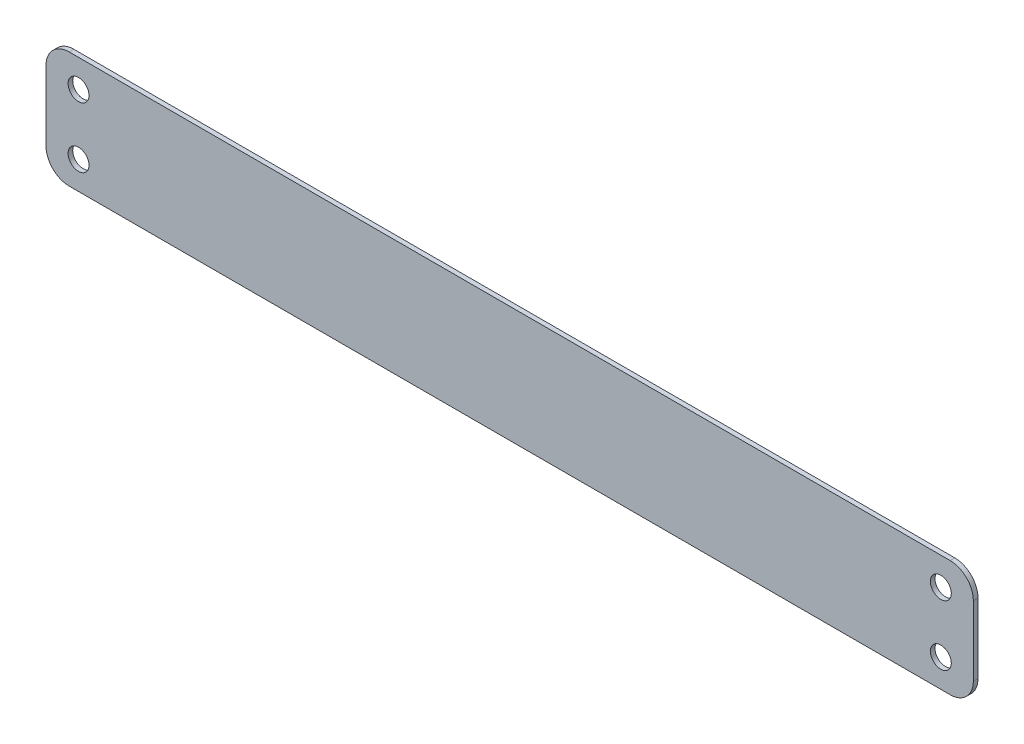
ISO-10303-21;
HEADER;
FILE_DESCRIPTION(('STEP AP214'),'2;1');
FILE_NAME('part.step','',(''),(''),'','','');
FILE_SCHEMA(('AUTOMOTIVE_DESIGN { 1 0 10303 214 1 1 1 1 }'));
ENDSEC;
DATA;
#1=APPLICATION_CONTEXT('core data for automotive mechanical design processes');
#2=APPLICATION_PROTOCOL_DEFINITION('international standard','automotive_design',2000,#1);
#3=PRODUCT_CONTEXT('',#1,'mechanical');
#4=PRODUCT('Part','Part','',(#3));
#5=PRODUCT_RELATED_PRODUCT_CATEGORY('part','',(#4));
#6=PRODUCT_DEFINITION_FORMATION('','',#4);
#7=PRODUCT_DEFINITION_CONTEXT('part definition',#1,'design');
#8=PRODUCT_DEFINITION('design','',#6,#7);
#9=PRODUCT_DEFINITION_SHAPE('','',#8);
#10=(LENGTH_UNIT() NAMED_UNIT(*) SI_UNIT(.MILLI.,.METRE.));
#11=(NAMED_UNIT(*) PLANE_ANGLE_UNIT() SI_UNIT($,.RADIAN.));
#12=(NAMED_UNIT(*) SI_UNIT($,.STERADIAN.) SOLID_ANGLE_UNIT());
#13=UNCERTAINTY_MEASURE_WITH_UNIT(LENGTH_MEASURE(1.E-05),#10,'distance_accuracy_value','');
#14=(GEOMETRIC_REPRESENTATION_CONTEXT(3) GLOBAL_UNCERTAINTY_ASSIGNED_CONTEXT((#13)) GLOBAL_UNIT_ASSIGNED_CONTEXT((#10,
#11,#12)) REPRESENTATION_CONTEXT('',''));
#15=CARTESIAN_POINT('',(0.,0.,0.));
#16=DIRECTION('',(0.,0.,1.));
#17=DIRECTION('',(1.,0.,0.));
#18=AXIS2_PLACEMENT_3D('',#15,#16,#17);
#19=CARTESIAN_POINT('',(199.5,-25.,-2.));
#20=DIRECTION('',(1.,0.,0.));
#21=DIRECTION('',(0.,0.,-1.));
#22=AXIS2_PLACEMENT_3D('',#19,#20,#21);
#23=PLANE('',#22);
#24=DIRECTION('',(0.,1.,0.));
#25=VECTOR('',#24,1.);
#26=CARTESIAN_POINT('',(199.5,-25.,-2.));
#27=LINE('',#26,#25);
#28=CARTESIAN_POINT('',(199.5,-15.,-2.));
#29=VERTEX_POINT('',#28);
#30=CARTESIAN_POINT('',(199.5,15.,-2.));
#31=VERTEX_POINT('',#30);
#32=EDGE_CURVE('E193',#29,#31,#27,.T.);
#33=ORIENTED_EDGE('',*,*,#32,.T.);
#34=DIRECTION('',(0.,0.,1.));
#35=VECTOR('',#34,1.);
#36=CARTESIAN_POINT('',(199.5,15.,-2.));
#37=LINE('',#36,#35);
#38=CARTESIAN_POINT('',(199.5,15.,0.));
#39=VERTEX_POINT('',#38);
#40=EDGE_CURVE('E127',#31,#39,#37,.T.);
#41=ORIENTED_EDGE('',*,*,#40,.T.);
#42=DIRECTION('',(0.,1.,0.));
#43=VECTOR('',#42,1.);
#44=CARTESIAN_POINT('',(199.5,-25.,0.));
#45=LINE('',#44,#43);
#46=CARTESIAN_POINT('',(199.5,-15.,0.));
#47=VERTEX_POINT('',#46);
#48=EDGE_CURVE('E110',#47,#39,#45,.T.);
#49=ORIENTED_EDGE('',*,*,#48,.F.);
#50=DIRECTION('',(0.,0.,1.));
#51=VECTOR('',#50,1.);
#52=CARTESIAN_POINT('',(199.5,-15.,-2.));
#53=LINE('',#52,#51);
#54=EDGE_CURVE('E124',#47,#29,#53,.F.);
#55=ORIENTED_EDGE('',*,*,#54,.T.);
#56=EDGE_LOOP('',(#33,#41,#49,#55));
#57=FACE_BOUND('',#56,.T.);
#58=ADVANCED_FACE('F40',(#57),#23,.T.);
#59=CARTESIAN_POINT('',(-199.5,-25.,-2.));
#60=DIRECTION('',(0.,-1.,0.));
#61=DIRECTION('',(0.,0.,-1.));
#62=AXIS2_PLACEMENT_3D('',#59,#60,#61);
#63=PLANE('',#62);
#64=DIRECTION('',(1.,0.,0.));
#65=VECTOR('',#64,1.);
#66=CARTESIAN_POINT('',(-199.5,-25.,0.));
#67=LINE('',#66,#65);
#68=CARTESIAN_POINT('',(-189.5,-25.,0.));
#69=VERTEX_POINT('',#68);
#70=CARTESIAN_POINT('',(189.5,-25.,0.));
#71=VERTEX_POINT('',#70);
#72=EDGE_CURVE('E112',#69,#71,#67,.T.);
#73=ORIENTED_EDGE('',*,*,#72,.F.);
#74=DIRECTION('',(0.,0.,1.));
#75=VECTOR('',#74,1.);
#76=CARTESIAN_POINT('',(-189.5,-25.,-2.));
#77=LINE('',#76,#75);
#78=CARTESIAN_POINT('',(-189.5,-25.,-2.));
#79=VERTEX_POINT('',#78);
#80=EDGE_CURVE('E11',#69,#79,#77,.F.);
#81=ORIENTED_EDGE('',*,*,#80,.T.);
#82=DIRECTION('',(1.,0.,0.));
#83=VECTOR('',#82,1.);
#84=CARTESIAN_POINT('',(-199.5,-25.,-2.));
#85=LINE('',#84,#83);
#86=CARTESIAN_POINT('',(189.5,-25.,-2.));
#87=VERTEX_POINT('',#86);
#88=EDGE_CURVE('E136',#79,#87,#85,.T.);
#89=ORIENTED_EDGE('',*,*,#88,.T.);
#90=DIRECTION('',(0.,0.,1.));
#91=VECTOR('',#90,1.);
#92=CARTESIAN_POINT('',(189.5,-25.,-2.));
#93=LINE('',#92,#91);
#94=EDGE_CURVE('E49',#87,#71,#93,.T.);
#95=ORIENTED_EDGE('',*,*,#94,.T.);
#96=EDGE_LOOP('',(#73,#81,#89,#95));
#97=FACE_BOUND('',#96,.T.);
#98=ADVANCED_FACE('F179',(#97),#63,.T.);
#99=CARTESIAN_POINT('',(-199.5,-25.,-2.));
#100=DIRECTION('',(-1.,0.,0.));
#101=DIRECTION('',(0.,0.,1.));
#102=AXIS2_PLACEMENT_3D('',#99,#100,#101);
#103=PLANE('',#102);
#104=DIRECTION('',(0.,-1.,0.));
#105=VECTOR('',#104,1.);
#106=CARTESIAN_POINT('',(-199.5,-25.,-2.));
#107=LINE('',#106,#105);
#108=CARTESIAN_POINT('',(-199.5,15.,-2.));
#109=VERTEX_POINT('',#108);
#110=CARTESIAN_POINT('',(-199.5,-15.,-2.));
#111=VERTEX_POINT('',#110);
#112=EDGE_CURVE('E144',#109,#111,#107,.T.);
#113=ORIENTED_EDGE('',*,*,#112,.T.);
#114=DIRECTION('',(0.,0.,1.));
#115=VECTOR('',#114,1.);
#116=CARTESIAN_POINT('',(-199.5,-15.,-2.));
#117=LINE('',#116,#115);
#118=CARTESIAN_POINT('',(-199.5,-15.,0.));
#119=VERTEX_POINT('',#118);
#120=EDGE_CURVE('E174',#111,#119,#117,.T.);
#121=ORIENTED_EDGE('',*,*,#120,.T.);
#122=DIRECTION('',(0.,-1.,0.));
#123=VECTOR('',#122,1.);
#124=CARTESIAN_POINT('',(-199.5,-25.,0.));
#125=LINE('',#124,#123);
#126=CARTESIAN_POINT('',(-199.5,15.,0.));
#127=VERTEX_POINT('',#126);
#128=EDGE_CURVE('E188',#127,#119,#125,.T.);
#129=ORIENTED_EDGE('',*,*,#128,.F.);
#130=DIRECTION('',(0.,0.,1.));
#131=VECTOR('',#130,1.);
#132=CARTESIAN_POINT('',(-199.5,15.,-2.));
#133=LINE('',#132,#131);
#134=EDGE_CURVE('E63',#127,#109,#133,.F.);
#135=ORIENTED_EDGE('',*,*,#134,.T.);
#136=EDGE_LOOP('',(#113,#121,#129,#135));
#137=FACE_BOUND('',#136,.T.);
#138=ADVANCED_FACE('F187',(#137),#103,.T.);
#139=CARTESIAN_POINT('',(-199.5,25.,-2.));
#140=DIRECTION('',(0.,1.,0.));
#141=DIRECTION('',(0.,0.,1.));
#142=AXIS2_PLACEMENT_3D('',#139,#140,#141);
#143=PLANE('',#142);
#144=DIRECTION('',(-1.,0.,0.));
#145=VECTOR('',#144,1.);
#146=CARTESIAN_POINT('',(-199.5,25.,0.));
#147=LINE('',#146,#145);
#148=CARTESIAN_POINT('',(189.5,25.,0.));
#149=VERTEX_POINT('',#148);
#150=CARTESIAN_POINT('',(-189.5,25.,0.));
#151=VERTEX_POINT('',#150);
#152=EDGE_CURVE('E129',#149,#151,#147,.T.);
#153=ORIENTED_EDGE('',*,*,#152,.F.);
#154=DIRECTION('',(0.,0.,1.));
#155=VECTOR('',#154,1.);
#156=CARTESIAN_POINT('',(189.5,25.,-2.));
#157=LINE('',#156,#155);
#158=CARTESIAN_POINT('',(189.5,25.,-2.));
#159=VERTEX_POINT('',#158);
#160=EDGE_CURVE('E160',#149,#159,#157,.F.);
#161=ORIENTED_EDGE('',*,*,#160,.T.);
#162=DIRECTION('',(-1.,0.,0.));
#163=VECTOR('',#162,1.);
#164=CARTESIAN_POINT('',(-199.5,25.,-2.));
#165=LINE('',#164,#163);
#166=CARTESIAN_POINT('',(-189.5,25.,-2.));
#167=VERTEX_POINT('',#166);
#168=EDGE_CURVE('E199',#159,#167,#165,.T.);
#169=ORIENTED_EDGE('',*,*,#168,.T.);
#170=DIRECTION('',(0.,0.,1.));
#171=VECTOR('',#170,1.);
#172=CARTESIAN_POINT('',(-189.5,25.,-2.));
#173=LINE('',#172,#171);
#174=EDGE_CURVE('E156',#167,#151,#173,.T.);
#175=ORIENTED_EDGE('',*,*,#174,.T.);
#176=EDGE_LOOP('',(#153,#161,#169,#175));
#177=FACE_BOUND('',#176,.T.);
#178=ADVANCED_FACE('F239',(#177),#143,.T.);
#179=CARTESIAN_POINT('',(0.,0.,-2.));
#180=DIRECTION('',(0.,0.,-1.));
#181=DIRECTION('',(-1.,0.,0.));
#182=AXIS2_PLACEMENT_3D('',#179,#180,#181);
#183=PLANE('',#182);
#184=CARTESIAN_POINT('',(-185.5,13.,-2.));
#185=DIRECTION('',(0.,0.,-1.));
#186=DIRECTION('',(-1.,0.,0.));
#187=AXIS2_PLACEMENT_3D('',#184,#185,#186);
#188=CIRCLE('',#187,4.5);
#189=CARTESIAN_POINT('',(-190.,13.,-2.));
#190=VERTEX_POINT('',#189);
#191=EDGE_CURVE('E230',#190,#190,#188,.T.);
#192=ORIENTED_EDGE('',*,*,#191,.F.);
#193=EDGE_LOOP('',(#192));
#194=FACE_BOUND('',#193,.T.);
#195=CARTESIAN_POINT('',(-185.5,-13.,-2.));
#196=DIRECTION('',(0.,0.,-1.));
#197=DIRECTION('',(-1.,0.,0.));
#198=AXIS2_PLACEMENT_3D('',#195,#196,#197);
#199=CIRCLE('',#198,4.5);
#200=CARTESIAN_POINT('',(-190.,-13.,-2.));
#201=VERTEX_POINT('',#200);
#202=EDGE_CURVE('E222',#201,#201,#199,.T.);
#203=ORIENTED_EDGE('',*,*,#202,.F.);
#204=EDGE_LOOP('',(#203));
#205=FACE_BOUND('',#204,.T.);
#206=CARTESIAN_POINT('',(185.5,13.,-2.));
#207=DIRECTION('',(0.,0.,-1.));
#208=DIRECTION('',(-1.,0.,0.));
#209=AXIS2_PLACEMENT_3D('',#206,#207,#208);
#210=CIRCLE('',#209,4.5);
#211=CARTESIAN_POINT('',(181.,13.,-2.));
#212=VERTEX_POINT('',#211);
#213=EDGE_CURVE('E215',#212,#212,#210,.T.);
#214=ORIENTED_EDGE('',*,*,#213,.F.);
#215=EDGE_LOOP('',(#214));
#216=FACE_BOUND('',#215,.T.);
#217=CARTESIAN_POINT('',(185.5,-13.,-2.));
#218=DIRECTION('',(0.,0.,-1.));
#219=DIRECTION('',(-1.,0.,0.));
#220=AXIS2_PLACEMENT_3D('',#217,#218,#219);
#221=CIRCLE('',#220,4.5);
#222=CARTESIAN_POINT('',(181.,-13.,-2.));
#223=VERTEX_POINT('',#222);
#224=EDGE_CURVE('E207',#223,#223,#221,.T.);
#225=ORIENTED_EDGE('',*,*,#224,.F.);
#226=EDGE_LOOP('',(#225));
#227=FACE_BOUND('',#226,.T.);
#228=ORIENTED_EDGE('',*,*,#168,.F.);
#229=CARTESIAN_POINT('',(189.5,15.,-2.));
#230=DIRECTION('',(0.,0.,-1.));
#231=DIRECTION('',(-1.,0.,0.));
#232=AXIS2_PLACEMENT_3D('',#229,#230,#231);
#233=CIRCLE('',#232,10.);
#234=EDGE_CURVE('E169',#159,#31,#233,.T.);
#235=ORIENTED_EDGE('',*,*,#234,.T.);
#236=ORIENTED_EDGE('',*,*,#32,.F.);
#237=CARTESIAN_POINT('',(189.5,-15.,-2.));
#238=DIRECTION('',(0.,0.,-1.));
#239=DIRECTION('',(-1.,0.,0.));
#240=AXIS2_PLACEMENT_3D('',#237,#238,#239);
#241=CIRCLE('',#240,10.);
#242=EDGE_CURVE('E134',#29,#87,#241,.T.);
#243=ORIENTED_EDGE('',*,*,#242,.T.);
#244=ORIENTED_EDGE('',*,*,#88,.F.);
#245=CARTESIAN_POINT('',(-189.5,-15.,-2.));
#246=DIRECTION('',(0.,0.,-1.));
#247=DIRECTION('',(-1.,0.,0.));
#248=AXIS2_PLACEMENT_3D('',#245,#246,#247);
#249=CIRCLE('',#248,10.);
#250=EDGE_CURVE('E56',#79,#111,#249,.T.);
#251=ORIENTED_EDGE('',*,*,#250,.T.);
#252=ORIENTED_EDGE('',*,*,#112,.F.);
#253=CARTESIAN_POINT('',(-189.5,15.,-2.));
#254=DIRECTION('',(0.,0.,-1.));
#255=DIRECTION('',(-1.,0.,0.));
#256=AXIS2_PLACEMENT_3D('',#253,#254,#255);
#257=CIRCLE('',#256,10.);
#258=EDGE_CURVE('E163',#109,#167,#257,.T.);
#259=ORIENTED_EDGE('',*,*,#258,.T.);
#260=EDGE_LOOP('',(#228,#235,#236,#243,#244,#251,#252,#259));
#261=FACE_BOUND('',#260,.T.);
#262=ADVANCED_FACE('F182',(#194,#205,#216,#227,#261),#183,.T.);
#263=CARTESIAN_POINT('',(0.,0.,0.));
#264=DIRECTION('',(0.,0.,-1.));
#265=DIRECTION('',(-1.,0.,0.));
#266=AXIS2_PLACEMENT_3D('',#263,#264,#265);
#267=PLANE('',#266);
#268=CARTESIAN_POINT('',(-185.5,13.,0.));
#269=DIRECTION('',(0.,0.,-1.));
#270=DIRECTION('',(-1.,0.,0.));
#271=AXIS2_PLACEMENT_3D('',#268,#269,#270);
#272=CIRCLE('',#271,4.5);
#273=CARTESIAN_POINT('',(-190.,13.,0.));
#274=VERTEX_POINT('',#273);
#275=EDGE_CURVE('E226',#274,#274,#272,.T.);
#276=ORIENTED_EDGE('',*,*,#275,.T.);
#277=EDGE_LOOP('',(#276));
#278=FACE_BOUND('',#277,.T.);
#279=CARTESIAN_POINT('',(-185.5,-13.,0.));
#280=DIRECTION('',(0.,0.,-1.));
#281=DIRECTION('',(-1.,0.,0.));
#282=AXIS2_PLACEMENT_3D('',#279,#280,#281);
#283=CIRCLE('',#282,4.5);
#284=CARTESIAN_POINT('',(-190.,-13.,0.));
#285=VERTEX_POINT('',#284);
#286=EDGE_CURVE('E218',#285,#285,#283,.T.);
#287=ORIENTED_EDGE('',*,*,#286,.T.);
#288=EDGE_LOOP('',(#287));
#289=FACE_BOUND('',#288,.T.);
#290=CARTESIAN_POINT('',(185.5,13.,0.));
#291=DIRECTION('',(0.,0.,-1.));
#292=DIRECTION('',(-1.,0.,0.));
#293=AXIS2_PLACEMENT_3D('',#290,#291,#292);
#294=CIRCLE('',#293,4.5);
#295=CARTESIAN_POINT('',(181.,13.,0.));
#296=VERTEX_POINT('',#295);
#297=EDGE_CURVE('E211',#296,#296,#294,.T.);
#298=ORIENTED_EDGE('',*,*,#297,.T.);
#299=EDGE_LOOP('',(#298));
#300=FACE_BOUND('',#299,.T.);
#301=CARTESIAN_POINT('',(185.5,-13.,0.));
#302=DIRECTION('',(0.,0.,-1.));
#303=DIRECTION('',(-1.,0.,0.));
#304=AXIS2_PLACEMENT_3D('',#301,#302,#303);
#305=CIRCLE('',#304,4.5);
#306=CARTESIAN_POINT('',(181.,-13.,0.));
#307=VERTEX_POINT('',#306);
#308=EDGE_CURVE('E130',#307,#307,#305,.T.);
#309=ORIENTED_EDGE('',*,*,#308,.T.);
#310=EDGE_LOOP('',(#309));
#311=FACE_BOUND('',#310,.T.);
#312=ORIENTED_EDGE('',*,*,#48,.T.);
#313=CARTESIAN_POINT('',(189.5,15.,0.));
#314=DIRECTION('',(0.,0.,-1.));
#315=DIRECTION('',(-1.,0.,0.));
#316=AXIS2_PLACEMENT_3D('',#313,#314,#315);
#317=CIRCLE('',#316,10.);
#318=EDGE_CURVE('E153',#39,#149,#317,.F.);
#319=ORIENTED_EDGE('',*,*,#318,.T.);
#320=ORIENTED_EDGE('',*,*,#152,.T.);
#321=CARTESIAN_POINT('',(-189.5,15.,0.));
#322=DIRECTION('',(0.,0.,-1.));
#323=DIRECTION('',(-1.,0.,0.));
#324=AXIS2_PLACEMENT_3D('',#321,#322,#323);
#325=CIRCLE('',#324,10.);
#326=EDGE_CURVE('E119',#151,#127,#325,.F.);
#327=ORIENTED_EDGE('',*,*,#326,.T.);
#328=ORIENTED_EDGE('',*,*,#128,.T.);
#329=CARTESIAN_POINT('',(-189.5,-15.,0.));
#330=DIRECTION('',(0.,0.,-1.));
#331=DIRECTION('',(-1.,0.,0.));
#332=AXIS2_PLACEMENT_3D('',#329,#330,#331);
#333=CIRCLE('',#332,10.);
#334=EDGE_CURVE('E118',#119,#69,#333,.F.);
#335=ORIENTED_EDGE('',*,*,#334,.T.);
#336=ORIENTED_EDGE('',*,*,#72,.T.);
#337=CARTESIAN_POINT('',(189.5,-15.,0.));
#338=DIRECTION('',(0.,0.,-1.));
#339=DIRECTION('',(-1.,0.,0.));
#340=AXIS2_PLACEMENT_3D('',#337,#338,#339);
#341=CIRCLE('',#340,10.);
#342=EDGE_CURVE('E107',#71,#47,#341,.F.);
#343=ORIENTED_EDGE('',*,*,#342,.T.);
#344=EDGE_LOOP('',(#312,#319,#320,#327,#328,#335,#336,#343));
#345=FACE_BOUND('',#344,.T.);
#346=ADVANCED_FACE('F109',(#278,#289,#300,#311,#345),#267,.F.);
#347=CARTESIAN_POINT('',(189.5,15.,-2.));
#348=DIRECTION('',(0.,0.,1.));
#349=DIRECTION('',(1.,0.,0.));
#350=AXIS2_PLACEMENT_3D('',#347,#348,#349);
#351=CYLINDRICAL_SURFACE('',#350,10.);
#352=ORIENTED_EDGE('',*,*,#234,.F.);
#353=ORIENTED_EDGE('',*,*,#160,.F.);
#354=ORIENTED_EDGE('',*,*,#318,.F.);
#355=ORIENTED_EDGE('',*,*,#40,.F.);
#356=EDGE_LOOP('',(#352,#353,#354,#355));
#357=FACE_BOUND('',#356,.T.);
#358=ADVANCED_FACE('F270',(#357),#351,.T.);
#359=CARTESIAN_POINT('',(-189.5,-15.,-2.));
#360=DIRECTION('',(0.,0.,1.));
#361=DIRECTION('',(1.,0.,0.));
#362=AXIS2_PLACEMENT_3D('',#359,#360,#361);
#363=CYLINDRICAL_SURFACE('',#362,10.);
#364=ORIENTED_EDGE('',*,*,#250,.F.);
#365=ORIENTED_EDGE('',*,*,#80,.F.);
#366=ORIENTED_EDGE('',*,*,#334,.F.);
#367=ORIENTED_EDGE('',*,*,#120,.F.);
#368=EDGE_LOOP('',(#364,#365,#366,#367));
#369=FACE_BOUND('',#368,.T.);
#370=ADVANCED_FACE('F185',(#369),#363,.T.);
#371=CARTESIAN_POINT('',(189.5,-15.,-2.));
#372=DIRECTION('',(0.,0.,1.));
#373=DIRECTION('',(1.,0.,0.));
#374=AXIS2_PLACEMENT_3D('',#371,#372,#373);
#375=CYLINDRICAL_SURFACE('',#374,10.);
#376=ORIENTED_EDGE('',*,*,#242,.F.);
#377=ORIENTED_EDGE('',*,*,#54,.F.);
#378=ORIENTED_EDGE('',*,*,#342,.F.);
#379=ORIENTED_EDGE('',*,*,#94,.F.);
#380=EDGE_LOOP('',(#376,#377,#378,#379));
#381=FACE_BOUND('',#380,.T.);
#382=ADVANCED_FACE('F133',(#381),#375,.T.);
#383=CARTESIAN_POINT('',(-189.5,15.,-2.));
#384=DIRECTION('',(0.,0.,1.));
#385=DIRECTION('',(1.,0.,0.));
#386=AXIS2_PLACEMENT_3D('',#383,#384,#385);
#387=CYLINDRICAL_SURFACE('',#386,10.);
#388=ORIENTED_EDGE('',*,*,#258,.F.);
#389=ORIENTED_EDGE('',*,*,#134,.F.);
#390=ORIENTED_EDGE('',*,*,#326,.F.);
#391=ORIENTED_EDGE('',*,*,#174,.F.);
#392=EDGE_LOOP('',(#388,#389,#390,#391));
#393=FACE_BOUND('',#392,.T.);
#394=ADVANCED_FACE('F42',(#393),#387,.T.);
#395=CARTESIAN_POINT('',(185.5,-13.,-2.));
#396=DIRECTION('',(0.,0.,-1.));
#397=DIRECTION('',(-1.,0.,0.));
#398=AXIS2_PLACEMENT_3D('',#395,#396,#397);
#399=CYLINDRICAL_SURFACE('',#398,4.5);
#400=ORIENTED_EDGE('',*,*,#308,.F.);
#401=EDGE_LOOP('',(#400));
#402=FACE_BOUND('',#401,.T.);
#403=ORIENTED_EDGE('',*,*,#224,.T.);
#404=EDGE_LOOP('',(#403));
#405=FACE_BOUND('',#404,.T.);
#406=ADVANCED_FACE('F247',(#402,#405),#399,.F.);
#407=CARTESIAN_POINT('',(185.5,13.,-2.));
#408=DIRECTION('',(0.,0.,-1.));
#409=DIRECTION('',(-1.,0.,0.));
#410=AXIS2_PLACEMENT_3D('',#407,#408,#409);
#411=CYLINDRICAL_SURFACE('',#410,4.5);
#412=ORIENTED_EDGE('',*,*,#297,.F.);
#413=EDGE_LOOP('',(#412));
#414=FACE_BOUND('',#413,.T.);
#415=ORIENTED_EDGE('',*,*,#213,.T.);
#416=EDGE_LOOP('',(#415));
#417=FACE_BOUND('',#416,.T.);
#418=ADVANCED_FACE('F249',(#414,#417),#411,.F.);
#419=CARTESIAN_POINT('',(-185.5,-13.,-2.));
#420=DIRECTION('',(0.,0.,-1.));
#421=DIRECTION('',(-1.,0.,0.));
#422=AXIS2_PLACEMENT_3D('',#419,#420,#421);
#423=CYLINDRICAL_SURFACE('',#422,4.5);
#424=ORIENTED_EDGE('',*,*,#286,.F.);
#425=EDGE_LOOP('',(#424));
#426=FACE_BOUND('',#425,.T.);
#427=ORIENTED_EDGE('',*,*,#202,.T.);
#428=EDGE_LOOP('',(#427));
#429=FACE_BOUND('',#428,.T.);
#430=ADVANCED_FACE('F256',(#426,#429),#423,.F.);
#431=CARTESIAN_POINT('',(-185.5,13.,-2.));
#432=DIRECTION('',(0.,0.,-1.));
#433=DIRECTION('',(-1.,0.,0.));
#434=AXIS2_PLACEMENT_3D('',#431,#432,#433);
#435=CYLINDRICAL_SURFACE('',#434,4.5);
#436=ORIENTED_EDGE('',*,*,#275,.F.);
#437=EDGE_LOOP('',(#436));
#438=FACE_BOUND('',#437,.T.);
#439=ORIENTED_EDGE('',*,*,#191,.T.);
#440=EDGE_LOOP('',(#439));
#441=FACE_BOUND('',#440,.T.);
#442=ADVANCED_FACE('F235',(#438,#441),#435,.F.);
#443=CLOSED_SHELL('',(#58,#98,#138,#178,#262,#346,#358,#370,#382,#394,#406,#418,#430,#442));
#444=MANIFOLD_SOLID_BREP('B2',#443);
#445=ADVANCED_BREP_SHAPE_REPRESENTATION('',(#18,#444),#14);
#446=SHAPE_DEFINITION_REPRESENTATION(#9,#445);
ENDSEC;
END-ISO-10303-21;
